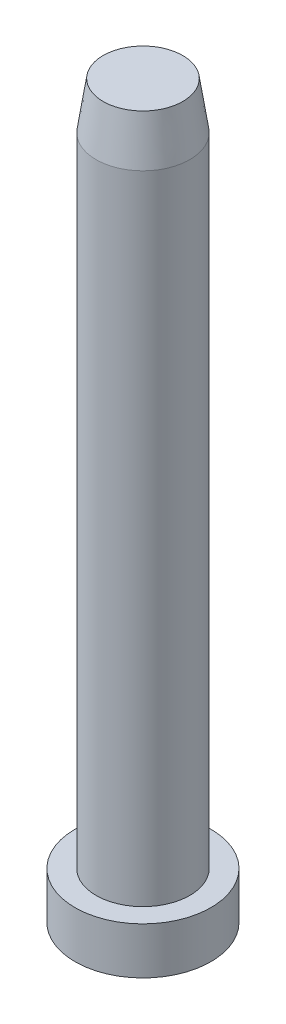
ISO-10303-21;
HEADER;
FILE_DESCRIPTION(('STEP AP214'),'2;1');
FILE_NAME('part.step','',(''),(''),'','','');
FILE_SCHEMA(('AUTOMOTIVE_DESIGN { 1 0 10303 214 1 1 1 1 }'));
ENDSEC;
DATA;
#1=APPLICATION_CONTEXT('core data for automotive mechanical design processes');
#2=APPLICATION_PROTOCOL_DEFINITION('international standard','automotive_design',2000,#1);
#3=PRODUCT_CONTEXT('',#1,'mechanical');
#4=PRODUCT('Part','Part','',(#3));
#5=PRODUCT_RELATED_PRODUCT_CATEGORY('part','',(#4));
#6=PRODUCT_DEFINITION_FORMATION('','',#4);
#7=PRODUCT_DEFINITION_CONTEXT('part definition',#1,'design');
#8=PRODUCT_DEFINITION('design','',#6,#7);
#9=PRODUCT_DEFINITION_SHAPE('','',#8);
#10=(LENGTH_UNIT() NAMED_UNIT(*) SI_UNIT(.MILLI.,.METRE.));
#11=(NAMED_UNIT(*) PLANE_ANGLE_UNIT() SI_UNIT($,.RADIAN.));
#12=(NAMED_UNIT(*) SI_UNIT($,.STERADIAN.) SOLID_ANGLE_UNIT());
#13=UNCERTAINTY_MEASURE_WITH_UNIT(LENGTH_MEASURE(1.E-05),#10,'distance_accuracy_value','');
#14=(GEOMETRIC_REPRESENTATION_CONTEXT(3) GLOBAL_UNCERTAINTY_ASSIGNED_CONTEXT((#13)) GLOBAL_UNIT_ASSIGNED_CONTEXT((#10,
#11,#12)) REPRESENTATION_CONTEXT('',''));
#15=CARTESIAN_POINT('',(0.,0.,0.));
#16=DIRECTION('',(0.,0.,1.));
#17=DIRECTION('',(1.,0.,0.));
#18=AXIS2_PLACEMENT_3D('',#15,#16,#17);
#19=CARTESIAN_POINT('',(0.,0.,0.));
#20=DIRECTION('',(0.,1.,0.));
#21=DIRECTION('',(-1.,0.,0.));
#22=AXIS2_PLACEMENT_3D('',#19,#20,#21);
#23=PLANE('',#22);
#24=CARTESIAN_POINT('',(0.,0.,0.));
#25=DIRECTION('',(0.,1.,0.));
#26=DIRECTION('',(-1.,0.,0.));
#27=AXIS2_PLACEMENT_3D('',#24,#25,#26);
#28=CIRCLE('',#27,7.25);
#29=CARTESIAN_POINT('',(-7.25,0.,0.));
#30=VERTEX_POINT('',#29);
#31=EDGE_CURVE('E10',#30,#30,#28,.T.);
#32=ORIENTED_EDGE('',*,*,#31,.F.);
#33=EDGE_LOOP('',(#32));
#34=FACE_BOUND('',#33,.T.);
#35=ADVANCED_FACE('F32',(#34),#23,.F.);
#36=CARTESIAN_POINT('',(0.,78.,0.));
#37=DIRECTION('',(0.,1.,0.));
#38=DIRECTION('',(-1.,0.,0.));
#39=AXIS2_PLACEMENT_3D('',#36,#37,#38);
#40=CYLINDRICAL_SURFACE('',#39,7.25);
#41=CARTESIAN_POINT('',(0.,5.,0.));
#42=DIRECTION('',(0.,1.,0.));
#43=DIRECTION('',(-1.,0.,0.));
#44=AXIS2_PLACEMENT_3D('',#41,#42,#43);
#45=CIRCLE('',#44,7.25);
#46=CARTESIAN_POINT('',(-7.25,5.,0.));
#47=VERTEX_POINT('',#46);
#48=EDGE_CURVE('E38',#47,#47,#45,.T.);
#49=ORIENTED_EDGE('',*,*,#48,.F.);
#50=EDGE_LOOP('',(#49));
#51=FACE_BOUND('',#50,.T.);
#52=ORIENTED_EDGE('',*,*,#31,.T.);
#53=EDGE_LOOP('',(#52));
#54=FACE_BOUND('',#53,.T.);
#55=ADVANCED_FACE('F71',(#51,#54),#40,.T.);
#56=CARTESIAN_POINT('',(7.25,5.,0.));
#57=DIRECTION('',(0.,-1.,0.));
#58=DIRECTION('',(1.,0.,0.));
#59=AXIS2_PLACEMENT_3D('',#56,#57,#58);
#60=PLANE('',#59);
#61=CARTESIAN_POINT('',(0.,5.,0.));
#62=DIRECTION('',(0.,1.,0.));
#63=DIRECTION('',(-1.,0.,0.));
#64=AXIS2_PLACEMENT_3D('',#61,#62,#63);
#65=CIRCLE('',#64,5.);
#66=CARTESIAN_POINT('',(-5.,5.,0.));
#67=VERTEX_POINT('',#66);
#68=EDGE_CURVE('E42',#67,#67,#65,.T.);
#69=ORIENTED_EDGE('',*,*,#68,.F.);
#70=EDGE_LOOP('',(#69));
#71=FACE_BOUND('',#70,.T.);
#72=ORIENTED_EDGE('',*,*,#48,.T.);
#73=EDGE_LOOP('',(#72));
#74=FACE_BOUND('',#73,.T.);
#75=ADVANCED_FACE('F66',(#71,#74),#60,.F.);
#76=CARTESIAN_POINT('',(0.,78.,0.));
#77=DIRECTION('',(0.,1.,0.));
#78=DIRECTION('',(-1.,0.,0.));
#79=AXIS2_PLACEMENT_3D('',#76,#77,#78);
#80=CYLINDRICAL_SURFACE('',#79,5.);
#81=CARTESIAN_POINT('',(0.,73.,0.));
#82=DIRECTION('',(0.,1.,0.));
#83=DIRECTION('',(-1.,0.,0.));
#84=AXIS2_PLACEMENT_3D('',#81,#82,#83);
#85=CIRCLE('',#84,5.);
#86=CARTESIAN_POINT('',(-5.00000000000001,73.,0.));
#87=VERTEX_POINT('',#86);
#88=EDGE_CURVE('E46',#87,#87,#85,.T.);
#89=ORIENTED_EDGE('',*,*,#88,.F.);
#90=EDGE_LOOP('',(#89));
#91=FACE_BOUND('',#90,.T.);
#92=ORIENTED_EDGE('',*,*,#68,.T.);
#93=EDGE_LOOP('',(#92));
#94=FACE_BOUND('',#93,.T.);
#95=ADVANCED_FACE('F60',(#91,#94),#80,.T.);
#96=CARTESIAN_POINT('',(0.,73.,0.));
#97=DIRECTION('',(0.,-1.,0.));
#98=DIRECTION('',(1.,0.,0.));
#99=AXIS2_PLACEMENT_3D('',#96,#97,#98);
#100=CONICAL_SURFACE('',#99,5.,0.148889947609497);
#101=CARTESIAN_POINT('',(0.,78.,0.));
#102=DIRECTION('',(0.,1.,0.));
#103=DIRECTION('',(-1.,0.,0.));
#104=AXIS2_PLACEMENT_3D('',#101,#102,#103);
#105=CIRCLE('',#104,4.25);
#106=CARTESIAN_POINT('',(-4.25000000000001,78.,0.));
#107=VERTEX_POINT('',#106);
#108=EDGE_CURVE('E51',#107,#107,#105,.T.);
#109=ORIENTED_EDGE('',*,*,#108,.F.);
#110=EDGE_LOOP('',(#109));
#111=FACE_BOUND('',#110,.T.);
#112=ORIENTED_EDGE('',*,*,#88,.T.);
#113=EDGE_LOOP('',(#112));
#114=FACE_BOUND('',#113,.T.);
#115=ADVANCED_FACE('F57',(#111,#114),#100,.T.);
#116=CARTESIAN_POINT('',(4.24999999999999,78.,0.));
#117=DIRECTION('',(0.,-1.,0.));
#118=DIRECTION('',(1.,0.,0.));
#119=AXIS2_PLACEMENT_3D('',#116,#117,#118);
#120=PLANE('',#119);
#121=ORIENTED_EDGE('',*,*,#108,.T.);
#122=EDGE_LOOP('',(#121));
#123=FACE_BOUND('',#122,.T.);
#124=ADVANCED_FACE('F55',(#123),#120,.F.);
#125=CLOSED_SHELL('',(#35,#55,#75,#95,#115,#124));
#126=MANIFOLD_SOLID_BREP('B2',#125);
#127=ADVANCED_BREP_SHAPE_REPRESENTATION('',(#18,#126),#14);
#128=SHAPE_DEFINITION_REPRESENTATION(#9,#127);
ENDSEC;
END-ISO-10303-21;
